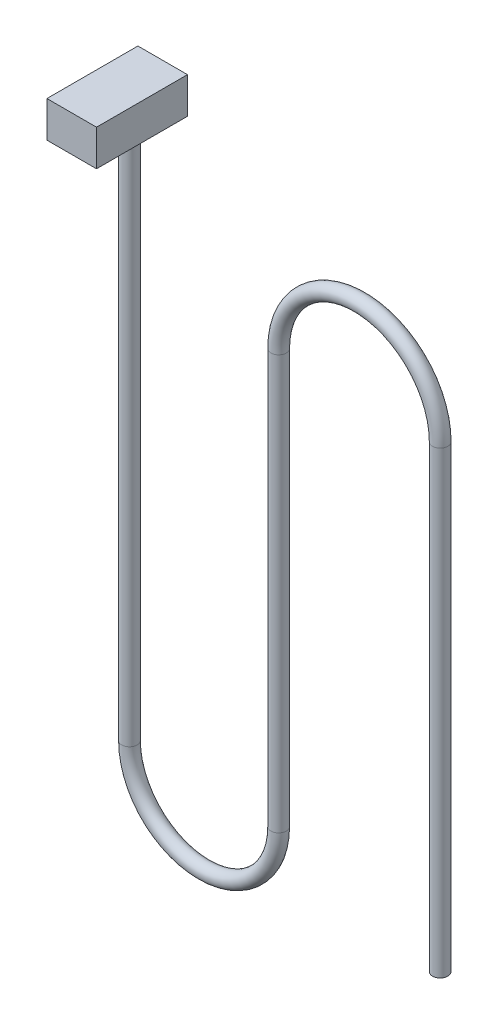
ISO-10303-21;
HEADER;
FILE_DESCRIPTION(('STEP AP214'),'2;1');
FILE_NAME('part.step','',(''),(''),'','','');
FILE_SCHEMA(('AUTOMOTIVE_DESIGN { 1 0 10303 214 1 1 1 1 }'));
ENDSEC;
DATA;
#1=APPLICATION_CONTEXT('core data for automotive mechanical design processes');
#2=APPLICATION_PROTOCOL_DEFINITION('international standard','automotive_design',2000,#1);
#3=PRODUCT_CONTEXT('',#1,'mechanical');
#4=PRODUCT('Part','Part','',(#3));
#5=PRODUCT_RELATED_PRODUCT_CATEGORY('part','',(#4));
#6=PRODUCT_DEFINITION_FORMATION('','',#4);
#7=PRODUCT_DEFINITION_CONTEXT('part definition',#1,'design');
#8=PRODUCT_DEFINITION('design','',#6,#7);
#9=PRODUCT_DEFINITION_SHAPE('','',#8);
#10=(LENGTH_UNIT() NAMED_UNIT(*) SI_UNIT(.MILLI.,.METRE.));
#11=(NAMED_UNIT(*) PLANE_ANGLE_UNIT() SI_UNIT($,.RADIAN.));
#12=(NAMED_UNIT(*) SI_UNIT($,.STERADIAN.) SOLID_ANGLE_UNIT());
#13=UNCERTAINTY_MEASURE_WITH_UNIT(LENGTH_MEASURE(1.E-05),#10,'distance_accuracy_value','');
#14=(GEOMETRIC_REPRESENTATION_CONTEXT(3) GLOBAL_UNCERTAINTY_ASSIGNED_CONTEXT((#13)) GLOBAL_UNIT_ASSIGNED_CONTEXT((#10,
#11,#12)) REPRESENTATION_CONTEXT('',''));
#15=CARTESIAN_POINT('',(0.,0.,0.));
#16=DIRECTION('',(0.,0.,1.));
#17=DIRECTION('',(1.,0.,0.));
#18=AXIS2_PLACEMENT_3D('',#15,#16,#17);
#19=CARTESIAN_POINT('',(-47.2308288776348,74.3308158869352,-15.));
#20=DIRECTION('',(1.,0.,0.));
#21=DIRECTION('',(0.,0.,-1.));
#22=AXIS2_PLACEMENT_3D('',#19,#20,#21);
#23=PLANE('',#22);
#24=DIRECTION('',(0.,1.,0.));
#25=VECTOR('',#24,1.);
#26=CARTESIAN_POINT('',(-47.2308288776348,74.3308158869352,0.));
#27=LINE('',#26,#25);
#28=CARTESIAN_POINT('',(-47.2308288776348,68.3840482356684,0.));
#29=VERTEX_POINT('',#28);
#30=CARTESIAN_POINT('',(-47.2308288776348,74.3308158869352,0.));
#31=VERTEX_POINT('',#30);
#32=EDGE_CURVE('E111',#29,#31,#27,.T.);
#33=ORIENTED_EDGE('',*,*,#32,.F.);
#34=DIRECTION('',(0.,0.,1.));
#35=VECTOR('',#34,1.);
#36=CARTESIAN_POINT('',(-47.2308288776348,68.3840482356684,-15.));
#37=LINE('',#36,#35);
#38=CARTESIAN_POINT('',(-47.2308288776348,68.3840482356684,-15.));
#39=VERTEX_POINT('',#38);
#40=EDGE_CURVE('E53',#39,#29,#37,.T.);
#41=ORIENTED_EDGE('',*,*,#40,.F.);
#42=DIRECTION('',(0.,1.,0.));
#43=VECTOR('',#42,1.);
#44=CARTESIAN_POINT('',(-47.2308288776348,74.3308158869352,-15.));
#45=LINE('',#44,#43);
#46=CARTESIAN_POINT('',(-47.2308288776348,74.3308158869352,-15.));
#47=VERTEX_POINT('',#46);
#48=EDGE_CURVE('E104',#39,#47,#45,.T.);
#49=ORIENTED_EDGE('',*,*,#48,.T.);
#50=DIRECTION('',(0.,0.,1.));
#51=VECTOR('',#50,1.);
#52=CARTESIAN_POINT('',(-47.2308288776348,74.3308158869352,-15.));
#53=LINE('',#52,#51);
#54=EDGE_CURVE('E47',#47,#31,#53,.T.);
#55=ORIENTED_EDGE('',*,*,#54,.T.);
#56=EDGE_LOOP('',(#33,#41,#49,#55));
#57=FACE_BOUND('',#56,.T.);
#58=ADVANCED_FACE('F44',(#57),#23,.T.);
#59=CARTESIAN_POINT('',(-47.2308288776348,68.3840482356684,-15.));
#60=DIRECTION('',(0.,-1.,0.));
#61=DIRECTION('',(0.,0.,-1.));
#62=AXIS2_PLACEMENT_3D('',#59,#60,#61);
#63=PLANE('',#62);
#64=CARTESIAN_POINT('',(-51.3195078269185,68.3840482356684,-9.52277603415988));
#65=DIRECTION('',(0.,-1.,0.));
#66=DIRECTION('',(0.,0.,-1.));
#67=AXIS2_PLACEMENT_3D('',#64,#65,#66);
#68=CIRCLE('',#67,1.27);
#69=CARTESIAN_POINT('',(-51.3195078269185,68.3840482356684,-10.7927760341599));
#70=VERTEX_POINT('',#69);
#71=EDGE_CURVE('E13',#70,#70,#68,.T.);
#72=ORIENTED_EDGE('',*,*,#71,.F.);
#73=EDGE_LOOP('',(#72));
#74=FACE_BOUND('',#73,.T.);
#75=DIRECTION('',(1.,0.,0.));
#76=VECTOR('',#75,1.);
#77=CARTESIAN_POINT('',(-47.2308288776348,68.3840482356684,0.));
#78=LINE('',#77,#76);
#79=CARTESIAN_POINT('',(-55.4081867762022,68.3840482356684,0.));
#80=VERTEX_POINT('',#79);
#81=EDGE_CURVE('E106',#80,#29,#78,.T.);
#82=ORIENTED_EDGE('',*,*,#81,.F.);
#83=DIRECTION('',(0.,0.,1.));
#84=VECTOR('',#83,1.);
#85=CARTESIAN_POINT('',(-55.4081867762022,68.3840482356684,-15.));
#86=LINE('',#85,#84);
#87=CARTESIAN_POINT('',(-55.4081867762022,68.3840482356684,-15.));
#88=VERTEX_POINT('',#87);
#89=EDGE_CURVE('E78',#88,#80,#86,.T.);
#90=ORIENTED_EDGE('',*,*,#89,.F.);
#91=DIRECTION('',(1.,0.,0.));
#92=VECTOR('',#91,1.);
#93=CARTESIAN_POINT('',(-47.2308288776348,68.3840482356684,-15.));
#94=LINE('',#93,#92);
#95=EDGE_CURVE('E101',#88,#39,#94,.T.);
#96=ORIENTED_EDGE('',*,*,#95,.T.);
#97=ORIENTED_EDGE('',*,*,#40,.T.);
#98=EDGE_LOOP('',(#82,#90,#96,#97));
#99=FACE_BOUND('',#98,.T.);
#100=ADVANCED_FACE('F123',(#74,#99),#63,.T.);
#101=CARTESIAN_POINT('',(-55.4081867762022,74.3308158869352,-15.));
#102=DIRECTION('',(-1.,0.,0.));
#103=DIRECTION('',(0.,0.,1.));
#104=AXIS2_PLACEMENT_3D('',#101,#102,#103);
#105=PLANE('',#104);
#106=DIRECTION('',(0.,-1.,0.));
#107=VECTOR('',#106,1.);
#108=CARTESIAN_POINT('',(-55.4081867762022,74.3308158869352,0.));
#109=LINE('',#108,#107);
#110=CARTESIAN_POINT('',(-55.4081867762022,74.3308158869352,0.));
#111=VERTEX_POINT('',#110);
#112=EDGE_CURVE('E96',#111,#80,#109,.T.);
#113=ORIENTED_EDGE('',*,*,#112,.F.);
#114=DIRECTION('',(0.,0.,1.));
#115=VECTOR('',#114,1.);
#116=CARTESIAN_POINT('',(-55.4081867762022,74.3308158869352,-15.));
#117=LINE('',#116,#115);
#118=CARTESIAN_POINT('',(-55.4081867762022,74.3308158869352,-15.));
#119=VERTEX_POINT('',#118);
#120=EDGE_CURVE('E91',#119,#111,#117,.T.);
#121=ORIENTED_EDGE('',*,*,#120,.F.);
#122=DIRECTION('',(0.,-1.,0.));
#123=VECTOR('',#122,1.);
#124=CARTESIAN_POINT('',(-55.4081867762022,74.3308158869352,-15.));
#125=LINE('',#124,#123);
#126=EDGE_CURVE('E94',#119,#88,#125,.T.);
#127=ORIENTED_EDGE('',*,*,#126,.T.);
#128=ORIENTED_EDGE('',*,*,#89,.T.);
#129=EDGE_LOOP('',(#113,#121,#127,#128));
#130=FACE_BOUND('',#129,.T.);
#131=ADVANCED_FACE('F93',(#130),#105,.T.);
#132=CARTESIAN_POINT('',(-47.2308288776348,74.3308158869352,-15.));
#133=DIRECTION('',(0.,1.,0.));
#134=DIRECTION('',(0.,0.,1.));
#135=AXIS2_PLACEMENT_3D('',#132,#133,#134);
#136=PLANE('',#135);
#137=DIRECTION('',(-1.,0.,0.));
#138=VECTOR('',#137,1.);
#139=CARTESIAN_POINT('',(-47.2308288776348,74.3308158869352,0.));
#140=LINE('',#139,#138);
#141=EDGE_CURVE('E114',#31,#111,#140,.T.);
#142=ORIENTED_EDGE('',*,*,#141,.F.);
#143=ORIENTED_EDGE('',*,*,#54,.F.);
#144=DIRECTION('',(-1.,0.,0.));
#145=VECTOR('',#144,1.);
#146=CARTESIAN_POINT('',(-47.2308288776348,74.3308158869352,-15.));
#147=LINE('',#146,#145);
#148=EDGE_CURVE('E100',#47,#119,#147,.T.);
#149=ORIENTED_EDGE('',*,*,#148,.T.);
#150=ORIENTED_EDGE('',*,*,#120,.T.);
#151=EDGE_LOOP('',(#142,#143,#149,#150));
#152=FACE_BOUND('',#151,.T.);
#153=ADVANCED_FACE('F103',(#152),#136,.T.);
#154=CARTESIAN_POINT('',(0.,0.,-15.));
#155=DIRECTION('',(0.,0.,-1.));
#156=DIRECTION('',(-1.,0.,0.));
#157=AXIS2_PLACEMENT_3D('',#154,#155,#156);
#158=PLANE('',#157);
#159=ORIENTED_EDGE('',*,*,#48,.F.);
#160=ORIENTED_EDGE('',*,*,#95,.F.);
#161=ORIENTED_EDGE('',*,*,#126,.F.);
#162=ORIENTED_EDGE('',*,*,#148,.F.);
#163=EDGE_LOOP('',(#159,#160,#161,#162));
#164=FACE_BOUND('',#163,.T.);
#165=ADVANCED_FACE('F99',(#164),#158,.T.);
#166=CARTESIAN_POINT('',(0.,0.,0.));
#167=DIRECTION('',(0.,0.,-1.));
#168=DIRECTION('',(-1.,0.,0.));
#169=AXIS2_PLACEMENT_3D('',#166,#167,#168);
#170=PLANE('',#169);
#171=ORIENTED_EDGE('',*,*,#32,.T.);
#172=ORIENTED_EDGE('',*,*,#141,.T.);
#173=ORIENTED_EDGE('',*,*,#112,.T.);
#174=ORIENTED_EDGE('',*,*,#81,.T.);
#175=EDGE_LOOP('',(#171,#172,#173,#174));
#176=FACE_BOUND('',#175,.T.);
#177=ADVANCED_FACE('F122',(#176),#170,.F.);
#178=CARTESIAN_POINT('',(-0.0913203466443926,48.2105462447525,-9.52277603415988));
#179=DIRECTION('',(0.,-1.,0.));
#180=DIRECTION('',(1.,0.,0.));
#181=AXIS2_PLACEMENT_3D('',#178,#179,#180);
#182=CYLINDRICAL_SURFACE('',#181,1.27);
#183=CARTESIAN_POINT('',(-0.0913203466443926,48.2105462447525,-9.52277603415988));
#184=DIRECTION('',(0.,-1.,0.));
#185=DIRECTION('',(0.,0.,-1.));
#186=AXIS2_PLACEMENT_3D('',#183,#184,#185);
#187=CIRCLE('',#186,1.27);
#188=CARTESIAN_POINT('',(1.17867965335561,48.2105462447525,-9.52277603415988));
#189=VERTEX_POINT('',#188);
#190=EDGE_CURVE('E171',#189,#189,#187,.T.);
#191=ORIENTED_EDGE('',*,*,#190,.T.);
#192=EDGE_LOOP('',(#191));
#193=FACE_BOUND('',#192,.T.);
#194=CARTESIAN_POINT('',(-0.0913203466443848,-27.4446465480387,-9.52277603415988));
#195=DIRECTION('',(0.,-1.,0.));
#196=DIRECTION('',(0.,0.,-1.));
#197=AXIS2_PLACEMENT_3D('',#194,#195,#196);
#198=CIRCLE('',#197,1.27);
#199=CARTESIAN_POINT('',(-0.0913203466443848,-27.4446465480387,-10.7927760341599));
#200=VERTEX_POINT('',#199);
#201=EDGE_CURVE('E115',#200,#200,#198,.T.);
#202=ORIENTED_EDGE('',*,*,#201,.F.);
#203=EDGE_LOOP('',(#202));
#204=FACE_BOUND('',#203,.T.);
#205=ADVANCED_FACE('F142',(#193,#204),#182,.T.);
#206=CARTESIAN_POINT('',(-13.4090775548894,48.2105462447525,-9.52277603415988));
#207=DIRECTION('',(0.,0.,-1.));
#208=DIRECTION('',(-1.,0.,0.));
#209=AXIS2_PLACEMENT_3D('',#206,#207,#208);
#210=TOROIDAL_SURFACE('',#209,13.317757208245,1.27);
#211=CARTESIAN_POINT('',(-26.7268347631344,48.2105462447525,-9.52277603415988));
#212=DIRECTION('',(0.,1.,0.));
#213=DIRECTION('',(0.,0.,-1.));
#214=AXIS2_PLACEMENT_3D('',#211,#212,#213);
#215=CIRCLE('',#214,1.27);
#216=CARTESIAN_POINT('',(-27.9968347631344,48.2105462447525,-9.52277603415988));
#217=VERTEX_POINT('',#216);
#218=EDGE_CURVE('E173',#217,#217,#215,.T.);
#219=CARTESIAN_POINT('',(-13.4090775548894,48.2105462447525,-9.52277603415988));
#220=DIRECTION('',(0.,0.,-1.));
#221=DIRECTION('',(-1.,0.,0.));
#222=AXIS2_PLACEMENT_3D('',#219,#220,#221);
#223=CIRCLE('',#222,14.587757208245);
#224=EDGE_CURVE('',#217,#189,#223,.T.);
#225=ORIENTED_EDGE('',*,*,#218,.T.);
#226=ORIENTED_EDGE('',*,*,#190,.F.);
#227=ORIENTED_EDGE('',*,*,#224,.T.);
#228=ORIENTED_EDGE('',*,*,#224,.F.);
#229=EDGE_LOOP('',(#225,#227,#226,#228));
#230=FACE_BOUND('',#229,.T.);
#231=ADVANCED_FACE('F146',(#230),#210,.T.);
#232=CARTESIAN_POINT('',(-26.7268347631344,-20.0489944452769,-9.52277603415988));
#233=DIRECTION('',(0.,1.,0.));
#234=DIRECTION('',(0.,0.,1.));
#235=AXIS2_PLACEMENT_3D('',#232,#233,#234);
#236=CYLINDRICAL_SURFACE('',#235,1.27);
#237=CARTESIAN_POINT('',(-26.7268347631344,-20.0489944452769,-9.52277603415988));
#238=DIRECTION('',(0.,1.,0.));
#239=DIRECTION('',(0.,0.,-1.));
#240=AXIS2_PLACEMENT_3D('',#237,#238,#239);
#241=CIRCLE('',#240,1.27);
#242=CARTESIAN_POINT('',(-25.4568347631344,-20.0489944452769,-9.52277603415988));
#243=VERTEX_POINT('',#242);
#244=EDGE_CURVE('E178',#243,#243,#241,.T.);
#245=ORIENTED_EDGE('',*,*,#244,.T.);
#246=EDGE_LOOP('',(#245));
#247=FACE_BOUND('',#246,.T.);
#248=ORIENTED_EDGE('',*,*,#218,.F.);
#249=EDGE_LOOP('',(#248));
#250=FACE_BOUND('',#249,.T.);
#251=ADVANCED_FACE('F150',(#247,#250),#236,.T.);
#252=CARTESIAN_POINT('',(-39.0231712950264,-20.0489944452769,-9.52277603415988));
#253=DIRECTION('',(0.,0.,1.));
#254=DIRECTION('',(1.,0.,0.));
#255=AXIS2_PLACEMENT_3D('',#252,#253,#254);
#256=TOROIDAL_SURFACE('',#255,12.2963365318921,1.27);
#257=CARTESIAN_POINT('',(-51.3195078269185,-20.0489944452769,-9.52277603415988));
#258=DIRECTION('',(0.,-1.,0.));
#259=DIRECTION('',(0.,0.,-1.));
#260=AXIS2_PLACEMENT_3D('',#257,#258,#259);
#261=CIRCLE('',#260,1.27);
#262=CARTESIAN_POINT('',(-52.5895078269185,-20.0489944452769,-9.52277603415988));
#263=VERTEX_POINT('',#262);
#264=EDGE_CURVE('E180',#263,#263,#261,.T.);
#265=CARTESIAN_POINT('',(-39.0231712950264,-20.0489944452769,-9.52277603415988));
#266=DIRECTION('',(0.,0.,1.));
#267=DIRECTION('',(1.,0.,0.));
#268=AXIS2_PLACEMENT_3D('',#265,#266,#267);
#269=CIRCLE('',#268,13.5663365318921);
#270=EDGE_CURVE('',#263,#243,#269,.T.);
#271=ORIENTED_EDGE('',*,*,#264,.T.);
#272=ORIENTED_EDGE('',*,*,#244,.F.);
#273=ORIENTED_EDGE('',*,*,#270,.T.);
#274=ORIENTED_EDGE('',*,*,#270,.F.);
#275=EDGE_LOOP('',(#271,#273,#272,#274));
#276=FACE_BOUND('',#275,.T.);
#277=ADVANCED_FACE('F154',(#276),#256,.T.);
#278=CARTESIAN_POINT('',(-51.3195078269185,-20.0489944452769,-9.52277603415988));
#279=DIRECTION('',(0.,1.,0.));
#280=DIRECTION('',(0.,0.,1.));
#281=AXIS2_PLACEMENT_3D('',#278,#279,#280);
#282=CYLINDRICAL_SURFACE('',#281,1.27);
#283=ORIENTED_EDGE('',*,*,#264,.F.);
#284=EDGE_LOOP('',(#283));
#285=FACE_BOUND('',#284,.T.);
#286=ORIENTED_EDGE('',*,*,#71,.T.);
#287=EDGE_LOOP('',(#286));
#288=FACE_BOUND('',#287,.T.);
#289=ADVANCED_FACE('F158',(#285,#288),#282,.T.);
#290=CARTESIAN_POINT('',(-0.0913203466443848,-27.4446465480387,-9.52277603415988));
#291=DIRECTION('',(0.,-1.,0.));
#292=DIRECTION('',(0.,0.,-1.));
#293=AXIS2_PLACEMENT_3D('',#290,#291,#292);
#294=PLANE('',#293);
#295=ORIENTED_EDGE('',*,*,#201,.T.);
#296=EDGE_LOOP('',(#295));
#297=FACE_BOUND('',#296,.T.);
#298=ADVANCED_FACE('F162',(#297),#294,.T.);
#299=CLOSED_SHELL('',(#58,#100,#131,#153,#165,#177,#205,#231,#251,#277,#289,#298));
#300=MANIFOLD_SOLID_BREP('B2',#299);
#301=ADVANCED_BREP_SHAPE_REPRESENTATION('',(#18,#300),#14);
#302=SHAPE_DEFINITION_REPRESENTATION(#9,#301);
ENDSEC;
END-ISO-10303-21;
